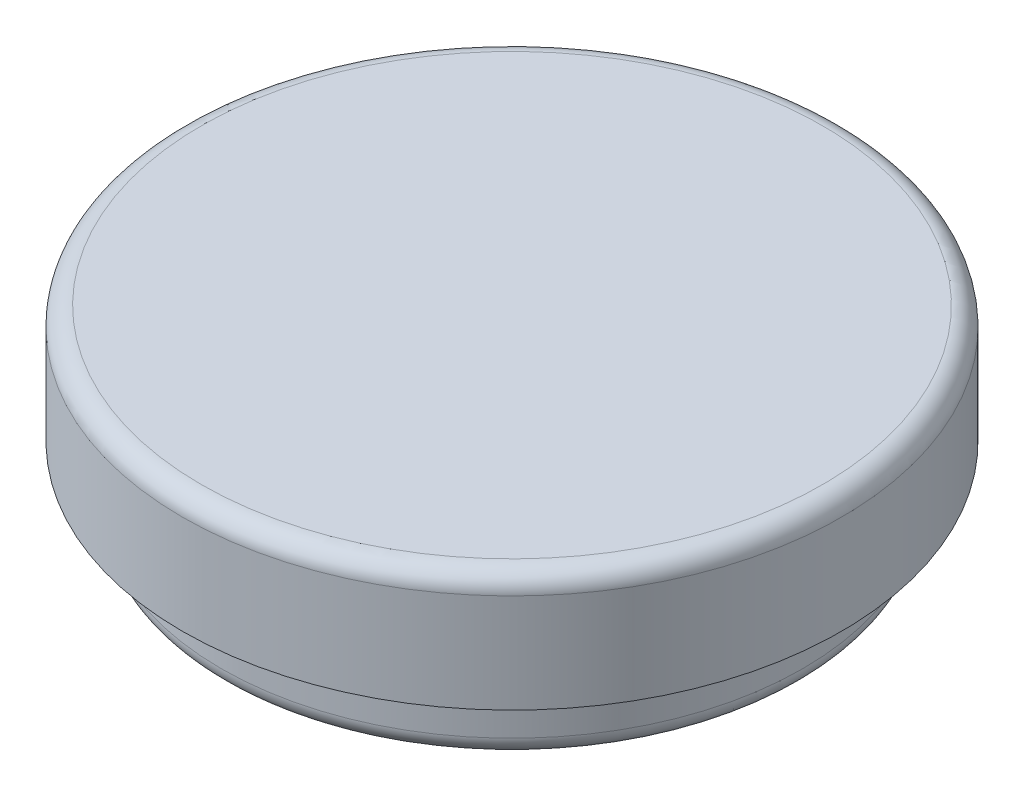
ISO-10303-21;
HEADER;
FILE_DESCRIPTION(('STEP AP214'),'2;1');
FILE_NAME('part.step','',(''),(''),'','','');
FILE_SCHEMA(('AUTOMOTIVE_DESIGN { 1 0 10303 214 1 1 1 1 }'));
ENDSEC;
DATA;
#1=APPLICATION_CONTEXT('core data for automotive mechanical design processes');
#2=APPLICATION_PROTOCOL_DEFINITION('international standard','automotive_design',2000,#1);
#3=PRODUCT_CONTEXT('',#1,'mechanical');
#4=PRODUCT('Part','Part','',(#3));
#5=PRODUCT_RELATED_PRODUCT_CATEGORY('part','',(#4));
#6=PRODUCT_DEFINITION_FORMATION('','',#4);
#7=PRODUCT_DEFINITION_CONTEXT('part definition',#1,'design');
#8=PRODUCT_DEFINITION('design','',#6,#7);
#9=PRODUCT_DEFINITION_SHAPE('','',#8);
#10=(LENGTH_UNIT() NAMED_UNIT(*) SI_UNIT(.MILLI.,.METRE.));
#11=(NAMED_UNIT(*) PLANE_ANGLE_UNIT() SI_UNIT($,.RADIAN.));
#12=(NAMED_UNIT(*) SI_UNIT($,.STERADIAN.) SOLID_ANGLE_UNIT());
#13=UNCERTAINTY_MEASURE_WITH_UNIT(LENGTH_MEASURE(1.E-05),#10,'distance_accuracy_value','');
#14=(GEOMETRIC_REPRESENTATION_CONTEXT(3) GLOBAL_UNCERTAINTY_ASSIGNED_CONTEXT((#13)) GLOBAL_UNIT_ASSIGNED_CONTEXT((#10,
#11,#12)) REPRESENTATION_CONTEXT('',''));
#15=CARTESIAN_POINT('',(0.,0.,0.));
#16=DIRECTION('',(0.,0.,1.));
#17=DIRECTION('',(1.,0.,0.));
#18=AXIS2_PLACEMENT_3D('',#15,#16,#17);
#19=CARTESIAN_POINT('',(0.,5.,0.));
#20=DIRECTION('',(0.,-1.,0.));
#21=DIRECTION('',(0.,0.,-1.));
#22=AXIS2_PLACEMENT_3D('',#19,#20,#21);
#23=CYLINDRICAL_SURFACE('',#22,14.);
#24=CARTESIAN_POINT('',(0.,4.2,0.));
#25=DIRECTION('',(0.,1.,0.));
#26=DIRECTION('',(0.,0.,1.));
#27=AXIS2_PLACEMENT_3D('',#24,#25,#26);
#28=CIRCLE('',#27,14.);
#29=CARTESIAN_POINT('',(0.,4.2,14.));
#30=VERTEX_POINT('',#29);
#31=EDGE_CURVE('E10',#30,#30,#28,.F.);
#32=ORIENTED_EDGE('',*,*,#31,.T.);
#33=EDGE_LOOP('',(#32));
#34=FACE_BOUND('',#33,.T.);
#35=CARTESIAN_POINT('',(0.,0.,0.));
#36=DIRECTION('',(0.,1.,0.));
#37=DIRECTION('',(0.,0.,1.));
#38=AXIS2_PLACEMENT_3D('',#35,#36,#37);
#39=CIRCLE('',#38,14.);
#40=CARTESIAN_POINT('',(0.,0.,14.));
#41=VERTEX_POINT('',#40);
#42=EDGE_CURVE('E62',#41,#41,#39,.T.);
#43=ORIENTED_EDGE('',*,*,#42,.T.);
#44=EDGE_LOOP('',(#43));
#45=FACE_BOUND('',#44,.T.);
#46=ADVANCED_FACE('F37',(#34,#45),#23,.T.);
#47=CARTESIAN_POINT('',(0.,5.,0.));
#48=DIRECTION('',(0.,1.,0.));
#49=DIRECTION('',(0.,0.,1.));
#50=AXIS2_PLACEMENT_3D('',#47,#48,#49);
#51=PLANE('',#50);
#52=CARTESIAN_POINT('',(0.,5.,0.));
#53=DIRECTION('',(0.,1.,0.));
#54=DIRECTION('',(0.,0.,1.));
#55=AXIS2_PLACEMENT_3D('',#52,#53,#54);
#56=CIRCLE('',#55,13.2);
#57=CARTESIAN_POINT('',(0.,5.,13.2));
#58=VERTEX_POINT('',#57);
#59=EDGE_CURVE('E45',#58,#58,#56,.T.);
#60=ORIENTED_EDGE('',*,*,#59,.T.);
#61=EDGE_LOOP('',(#60));
#62=FACE_BOUND('',#61,.T.);
#63=ADVANCED_FACE('F98',(#62),#51,.T.);
#64=CARTESIAN_POINT('',(0.,0.,0.));
#65=DIRECTION('',(0.,1.,0.));
#66=DIRECTION('',(0.,0.,1.));
#67=AXIS2_PLACEMENT_3D('',#64,#65,#66);
#68=PLANE('',#67);
#69=CARTESIAN_POINT('',(0.,0.,0.));
#70=DIRECTION('',(0.,-1.,0.));
#71=DIRECTION('',(0.,0.,-1.));
#72=AXIS2_PLACEMENT_3D('',#69,#70,#71);
#73=CIRCLE('',#72,12.35);
#74=CARTESIAN_POINT('',(0.,0.,-12.35));
#75=VERTEX_POINT('',#74);
#76=EDGE_CURVE('E61',#75,#75,#73,.T.);
#77=ORIENTED_EDGE('',*,*,#76,.F.);
#78=EDGE_LOOP('',(#77));
#79=FACE_BOUND('',#78,.T.);
#80=ORIENTED_EDGE('',*,*,#42,.F.);
#81=EDGE_LOOP('',(#80));
#82=FACE_BOUND('',#81,.T.);
#83=ADVANCED_FACE('F94',(#79,#82),#68,.F.);
#84=CARTESIAN_POINT('',(0.,-3.,0.));
#85=DIRECTION('',(0.,1.,0.));
#86=DIRECTION('',(0.,0.,1.));
#87=AXIS2_PLACEMENT_3D('',#84,#85,#86);
#88=CYLINDRICAL_SURFACE('',#87,12.35);
#89=CARTESIAN_POINT('',(0.,-2.2,0.));
#90=DIRECTION('',(0.,-1.,0.));
#91=DIRECTION('',(0.,0.,-1.));
#92=AXIS2_PLACEMENT_3D('',#89,#90,#91);
#93=CIRCLE('',#92,12.35);
#94=CARTESIAN_POINT('',(0.,-2.2,-12.35));
#95=VERTEX_POINT('',#94);
#96=EDGE_CURVE('E50',#95,#95,#93,.F.);
#97=ORIENTED_EDGE('',*,*,#96,.T.);
#98=EDGE_LOOP('',(#97));
#99=FACE_BOUND('',#98,.T.);
#100=ORIENTED_EDGE('',*,*,#76,.T.);
#101=EDGE_LOOP('',(#100));
#102=FACE_BOUND('',#101,.T.);
#103=ADVANCED_FACE('F88',(#99,#102),#88,.T.);
#104=CARTESIAN_POINT('',(0.,-3.,0.));
#105=DIRECTION('',(0.,-1.,0.));
#106=DIRECTION('',(0.,0.,-1.));
#107=AXIS2_PLACEMENT_3D('',#104,#105,#106);
#108=PLANE('',#107);
#109=CARTESIAN_POINT('',(0.,-3.,0.));
#110=DIRECTION('',(0.,-1.,0.));
#111=DIRECTION('',(0.,0.,-1.));
#112=AXIS2_PLACEMENT_3D('',#109,#110,#111);
#113=CIRCLE('',#112,11.55);
#114=CARTESIAN_POINT('',(0.,-3.,-11.55));
#115=VERTEX_POINT('',#114);
#116=EDGE_CURVE('E55',#115,#115,#113,.T.);
#117=ORIENTED_EDGE('',*,*,#116,.T.);
#118=EDGE_LOOP('',(#117));
#119=FACE_BOUND('',#118,.T.);
#120=CARTESIAN_POINT('',(0.,-3.,0.));
#121=DIRECTION('',(0.,-1.,0.));
#122=DIRECTION('',(0.,0.,-1.));
#123=AXIS2_PLACEMENT_3D('',#120,#121,#122);
#124=CIRCLE('',#123,11.);
#125=CARTESIAN_POINT('',(0.,-3.,-11.));
#126=VERTEX_POINT('',#125);
#127=EDGE_CURVE('E70',#126,#126,#124,.T.);
#128=ORIENTED_EDGE('',*,*,#127,.F.);
#129=EDGE_LOOP('',(#128));
#130=FACE_BOUND('',#129,.T.);
#131=ADVANCED_FACE('F83',(#119,#130),#108,.T.);
#132=CARTESIAN_POINT('',(0.,2.,0.));
#133=DIRECTION('',(0.,-1.,0.));
#134=DIRECTION('',(0.,0.,-1.));
#135=AXIS2_PLACEMENT_3D('',#132,#133,#134);
#136=CYLINDRICAL_SURFACE('',#135,11.);
#137=CARTESIAN_POINT('',(0.,2.,0.));
#138=DIRECTION('',(0.,-1.,0.));
#139=DIRECTION('',(0.,0.,-1.));
#140=AXIS2_PLACEMENT_3D('',#137,#138,#139);
#141=CIRCLE('',#140,11.);
#142=CARTESIAN_POINT('',(0.,2.,-11.));
#143=VERTEX_POINT('',#142);
#144=EDGE_CURVE('E66',#143,#143,#141,.T.);
#145=ORIENTED_EDGE('',*,*,#144,.F.);
#146=EDGE_LOOP('',(#145));
#147=FACE_BOUND('',#146,.T.);
#148=ORIENTED_EDGE('',*,*,#127,.T.);
#149=EDGE_LOOP('',(#148));
#150=FACE_BOUND('',#149,.T.);
#151=ADVANCED_FACE('F80',(#147,#150),#136,.F.);
#152=CARTESIAN_POINT('',(0.,2.,0.));
#153=DIRECTION('',(0.,-1.,0.));
#154=DIRECTION('',(0.,0.,-1.));
#155=AXIS2_PLACEMENT_3D('',#152,#153,#154);
#156=PLANE('',#155);
#157=ORIENTED_EDGE('',*,*,#144,.T.);
#158=EDGE_LOOP('',(#157));
#159=FACE_BOUND('',#158,.T.);
#160=ADVANCED_FACE('F78',(#159),#156,.T.);
#161=CARTESIAN_POINT('',(0.,-2.2,0.));
#162=DIRECTION('',(0.,-1.,0.));
#163=DIRECTION('',(0.,0.,-1.));
#164=AXIS2_PLACEMENT_3D('',#161,#162,#163);
#165=TOROIDAL_SURFACE('',#164,11.55,0.8);
#166=ORIENTED_EDGE('',*,*,#96,.F.);
#167=EDGE_LOOP('',(#166));
#168=FACE_BOUND('',#167,.T.);
#169=ORIENTED_EDGE('',*,*,#116,.F.);
#170=EDGE_LOOP('',(#169));
#171=FACE_BOUND('',#170,.T.);
#172=ADVANCED_FACE('F106',(#168,#171),#165,.T.);
#173=CARTESIAN_POINT('',(0.,4.2,0.));
#174=DIRECTION('',(0.,1.,0.));
#175=DIRECTION('',(0.,0.,1.));
#176=AXIS2_PLACEMENT_3D('',#173,#174,#175);
#177=TOROIDAL_SURFACE('',#176,13.2,0.8);
#178=ORIENTED_EDGE('',*,*,#31,.F.);
#179=EDGE_LOOP('',(#178));
#180=FACE_BOUND('',#179,.T.);
#181=ORIENTED_EDGE('',*,*,#59,.F.);
#182=EDGE_LOOP('',(#181));
#183=FACE_BOUND('',#182,.T.);
#184=ADVANCED_FACE('F39',(#180,#183),#177,.T.);
#185=CLOSED_SHELL('',(#46,#63,#83,#103,#131,#151,#160,#172,#184));
#186=MANIFOLD_SOLID_BREP('B2',#185);
#187=ADVANCED_BREP_SHAPE_REPRESENTATION('',(#18,#186),#14);
#188=SHAPE_DEFINITION_REPRESENTATION(#9,#187);
ENDSEC;
END-ISO-10303-21;
